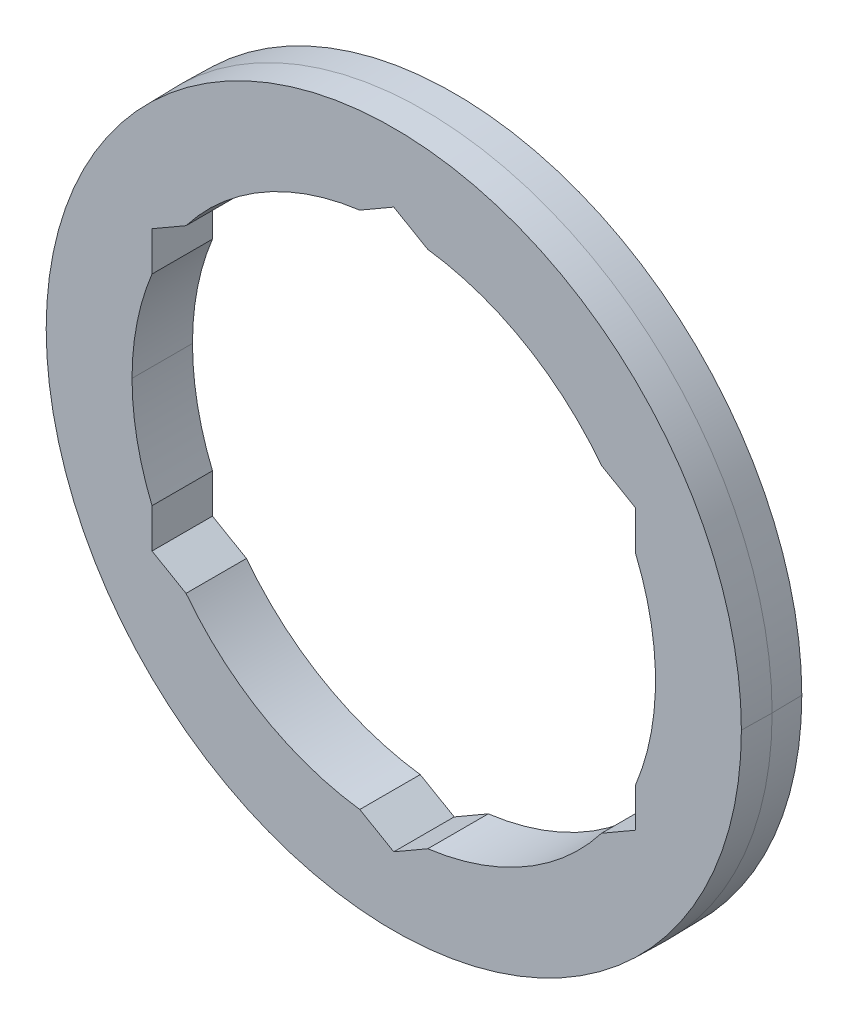
ISO-10303-21;
HEADER;
FILE_DESCRIPTION(('STEP AP214'),'2;1');
FILE_NAME('part.step','',(''),(''),'','','');
FILE_SCHEMA(('AUTOMOTIVE_DESIGN { 1 0 10303 214 1 1 1 1 }'));
ENDSEC;
DATA;
#1=APPLICATION_CONTEXT('core data for automotive mechanical design processes');
#2=APPLICATION_PROTOCOL_DEFINITION('international standard','automotive_design',2000,#1);
#3=PRODUCT_CONTEXT('',#1,'mechanical');
#4=PRODUCT('Part','Part','',(#3));
#5=PRODUCT_RELATED_PRODUCT_CATEGORY('part','',(#4));
#6=PRODUCT_DEFINITION_FORMATION('','',#4);
#7=PRODUCT_DEFINITION_CONTEXT('part definition',#1,'design');
#8=PRODUCT_DEFINITION('design','',#6,#7);
#9=PRODUCT_DEFINITION_SHAPE('','',#8);
#10=(LENGTH_UNIT() NAMED_UNIT(*) SI_UNIT(.MILLI.,.METRE.));
#11=(NAMED_UNIT(*) PLANE_ANGLE_UNIT() SI_UNIT($,.RADIAN.));
#12=(NAMED_UNIT(*) SI_UNIT($,.STERADIAN.) SOLID_ANGLE_UNIT());
#13=UNCERTAINTY_MEASURE_WITH_UNIT(LENGTH_MEASURE(1.E-05),#10,'distance_accuracy_value','');
#14=(GEOMETRIC_REPRESENTATION_CONTEXT(3) GLOBAL_UNCERTAINTY_ASSIGNED_CONTEXT((#13)) GLOBAL_UNIT_ASSIGNED_CONTEXT((#10,
#11,#12)) REPRESENTATION_CONTEXT('',''));
#15=CARTESIAN_POINT('',(0.,0.,0.));
#16=DIRECTION('',(0.,0.,1.));
#17=DIRECTION('',(1.,0.,0.));
#18=AXIS2_PLACEMENT_3D('',#15,#16,#17);
#19=CARTESIAN_POINT('',(0.,0.,-0.79375));
#20=DIRECTION('',(0.,0.,1.));
#21=DIRECTION('',(1.,0.,0.));
#22=AXIS2_PLACEMENT_3D('',#19,#20,#21);
#23=PLANE('',#22);
#24=CARTESIAN_POINT('',(0.,0.,-0.79375));
#25=DIRECTION('',(0.,0.,1.));
#26=DIRECTION('',(1.,0.,0.));
#27=AXIS2_PLACEMENT_3D('',#24,#25,#26);
#28=CIRCLE('',#27,6.874999966);
#29=CARTESIAN_POINT('',(5.45696042896782,4.18177084608655,-0.79375));
#30=VERTEX_POINT('',#29);
#31=CARTESIAN_POINT('',(0.89303957103219,6.81675178197583,-0.79375));
#32=VERTEX_POINT('',#31);
#33=EDGE_CURVE('E363',#30,#32,#28,.T.);
#34=ORIENTED_EDGE('',*,*,#33,.T.);
#35=DIRECTION('',(-0.866025403784439,0.5,0.));
#36=VECTOR('',#35,1.);
#37=CARTESIAN_POINT('',(3.175,5.49926131403119,-0.79375));
#38=LINE('',#37,#36);
#39=CARTESIAN_POINT('',(0.,7.33234841870825,-0.79375));
#40=VERTEX_POINT('',#39);
#41=EDGE_CURVE('E259',#32,#40,#38,.T.);
#42=ORIENTED_EDGE('',*,*,#41,.T.);
#43=DIRECTION('',(-0.866025403784439,-0.5,0.));
#44=VECTOR('',#43,1.);
#45=CARTESIAN_POINT('',(-3.175,5.49926131403119,-0.79375));
#46=LINE('',#45,#44);
#47=CARTESIAN_POINT('',(-0.893039571032188,6.81675178197583,-0.79375));
#48=VERTEX_POINT('',#47);
#49=EDGE_CURVE('E250',#40,#48,#46,.T.);
#50=ORIENTED_EDGE('',*,*,#49,.T.);
#51=CARTESIAN_POINT('',(0.,0.,-0.79375));
#52=DIRECTION('',(0.,0.,1.));
#53=DIRECTION('',(1.,0.,0.));
#54=AXIS2_PLACEMENT_3D('',#51,#52,#53);
#55=CIRCLE('',#54,6.874999966);
#56=CARTESIAN_POINT('',(-5.45696042896781,4.18177084608655,-0.79375));
#57=VERTEX_POINT('',#56);
#58=EDGE_CURVE('E219',#48,#57,#55,.T.);
#59=ORIENTED_EDGE('',*,*,#58,.T.);
#60=DIRECTION('',(-0.866025403784439,-0.5,0.));
#61=VECTOR('',#60,1.);
#62=CARTESIAN_POINT('',(-3.175,5.49926131403119,-0.79375));
#63=LINE('',#62,#61);
#64=CARTESIAN_POINT('',(-6.35,3.66617420935413,-0.79375));
#65=VERTEX_POINT('',#64);
#66=EDGE_CURVE('E243',#57,#65,#63,.T.);
#67=ORIENTED_EDGE('',*,*,#66,.T.);
#68=DIRECTION('',(0.,-1.,0.));
#69=VECTOR('',#68,1.);
#70=CARTESIAN_POINT('',(-6.35,0.,-0.79375));
#71=LINE('',#70,#69);
#72=CARTESIAN_POINT('',(-6.35,2.63498093588929,-0.79375));
#73=VERTEX_POINT('',#72);
#74=EDGE_CURVE('E278',#65,#73,#71,.T.);
#75=ORIENTED_EDGE('',*,*,#74,.T.);
#76=CARTESIAN_POINT('',(0.,0.,-0.79375));
#77=DIRECTION('',(0.,0.,1.));
#78=DIRECTION('',(1.,0.,0.));
#79=AXIS2_PLACEMENT_3D('',#76,#77,#78);
#80=CIRCLE('',#79,6.874999966);
#81=CARTESIAN_POINT('',(-6.874999966,0.,-0.79375));
#82=VERTEX_POINT('',#81);
#83=EDGE_CURVE('E396',#73,#82,#80,.T.);
#84=ORIENTED_EDGE('',*,*,#83,.T.);
#85=CARTESIAN_POINT('',(0.,0.,-0.79375));
#86=DIRECTION('',(0.,0.,1.));
#87=DIRECTION('',(1.,0.,0.));
#88=AXIS2_PLACEMENT_3D('',#85,#86,#87);
#89=CIRCLE('',#88,6.874999966);
#90=CARTESIAN_POINT('',(-6.35,-2.63498093588929,-0.79375));
#91=VERTEX_POINT('',#90);
#92=EDGE_CURVE('E282',#82,#91,#89,.T.);
#93=ORIENTED_EDGE('',*,*,#92,.T.);
#94=DIRECTION('',(0.,-1.,0.));
#95=VECTOR('',#94,1.);
#96=CARTESIAN_POINT('',(-6.35,0.,-0.79375));
#97=LINE('',#96,#95);
#98=CARTESIAN_POINT('',(-6.35,-3.66617420935412,-0.79375));
#99=VERTEX_POINT('',#98);
#100=EDGE_CURVE('E217',#91,#99,#97,.T.);
#101=ORIENTED_EDGE('',*,*,#100,.T.);
#102=DIRECTION('',(0.866025403784439,-0.5,0.));
#103=VECTOR('',#102,1.);
#104=CARTESIAN_POINT('',(-3.175,-5.49926131403119,-0.79375));
#105=LINE('',#104,#103);
#106=CARTESIAN_POINT('',(-5.45696042896782,-4.18177084608655,-0.79375));
#107=VERTEX_POINT('',#106);
#108=EDGE_CURVE('E336',#99,#107,#105,.T.);
#109=ORIENTED_EDGE('',*,*,#108,.T.);
#110=CARTESIAN_POINT('',(0.,0.,-0.79375));
#111=DIRECTION('',(0.,0.,1.));
#112=DIRECTION('',(1.,0.,0.));
#113=AXIS2_PLACEMENT_3D('',#110,#111,#112);
#114=CIRCLE('',#113,6.874999966);
#115=CARTESIAN_POINT('',(-0.893039571032186,-6.81675178197583,-0.79375));
#116=VERTEX_POINT('',#115);
#117=EDGE_CURVE('E328',#107,#116,#114,.T.);
#118=ORIENTED_EDGE('',*,*,#117,.T.);
#119=DIRECTION('',(0.866025403784439,-0.5,0.));
#120=VECTOR('',#119,1.);
#121=CARTESIAN_POINT('',(-3.175,-5.49926131403119,-0.79375));
#122=LINE('',#121,#120);
#123=CARTESIAN_POINT('',(0.,-7.33234841870825,-0.79375));
#124=VERTEX_POINT('',#123);
#125=EDGE_CURVE('E291',#116,#124,#122,.T.);
#126=ORIENTED_EDGE('',*,*,#125,.T.);
#127=DIRECTION('',(0.866025403784439,0.5,0.));
#128=VECTOR('',#127,1.);
#129=CARTESIAN_POINT('',(3.175,-5.49926131403119,-0.79375));
#130=LINE('',#129,#128);
#131=CARTESIAN_POINT('',(0.893039571032181,-6.81675178197583,-0.79375));
#132=VERTEX_POINT('',#131);
#133=EDGE_CURVE('E238',#124,#132,#130,.T.);
#134=ORIENTED_EDGE('',*,*,#133,.T.);
#135=CARTESIAN_POINT('',(0.,0.,-0.79375));
#136=DIRECTION('',(0.,0.,1.));
#137=DIRECTION('',(1.,0.,0.));
#138=AXIS2_PLACEMENT_3D('',#135,#136,#137);
#139=CIRCLE('',#138,6.874999966);
#140=CARTESIAN_POINT('',(5.45696042896782,-4.18177084608655,-0.79375));
#141=VERTEX_POINT('',#140);
#142=EDGE_CURVE('E228',#132,#141,#139,.T.);
#143=ORIENTED_EDGE('',*,*,#142,.T.);
#144=DIRECTION('',(0.866025403784439,0.5,0.));
#145=VECTOR('',#144,1.);
#146=CARTESIAN_POINT('',(3.175,-5.49926131403119,-0.79375));
#147=LINE('',#146,#145);
#148=CARTESIAN_POINT('',(6.35,-3.66617420935412,-0.79375));
#149=VERTEX_POINT('',#148);
#150=EDGE_CURVE('E182',#141,#149,#147,.T.);
#151=ORIENTED_EDGE('',*,*,#150,.T.);
#152=DIRECTION('',(0.,1.,0.));
#153=VECTOR('',#152,1.);
#154=CARTESIAN_POINT('',(6.35,0.,-0.79375));
#155=LINE('',#154,#153);
#156=CARTESIAN_POINT('',(6.35,-2.6349809358893,-0.79375));
#157=VERTEX_POINT('',#156);
#158=EDGE_CURVE('E174',#149,#157,#155,.T.);
#159=ORIENTED_EDGE('',*,*,#158,.T.);
#160=CARTESIAN_POINT('',(0.,0.,-0.79375));
#161=DIRECTION('',(0.,0.,1.));
#162=DIRECTION('',(1.,0.,0.));
#163=AXIS2_PLACEMENT_3D('',#160,#161,#162);
#164=CIRCLE('',#163,6.874999966);
#165=CARTESIAN_POINT('',(6.35,2.6349809358893,-0.79375));
#166=VERTEX_POINT('',#165);
#167=EDGE_CURVE('E179',#157,#166,#164,.T.);
#168=ORIENTED_EDGE('',*,*,#167,.T.);
#169=DIRECTION('',(0.,1.,0.));
#170=VECTOR('',#169,1.);
#171=CARTESIAN_POINT('',(6.35,0.,-0.79375));
#172=LINE('',#171,#170);
#173=CARTESIAN_POINT('',(6.35,3.66617420935413,-0.79375));
#174=VERTEX_POINT('',#173);
#175=EDGE_CURVE('E300',#166,#174,#172,.T.);
#176=ORIENTED_EDGE('',*,*,#175,.T.);
#177=DIRECTION('',(-0.866025403784439,0.5,0.));
#178=VECTOR('',#177,1.);
#179=CARTESIAN_POINT('',(3.175,5.49926131403119,-0.79375));
#180=LINE('',#179,#178);
#181=EDGE_CURVE('E315',#174,#30,#180,.T.);
#182=ORIENTED_EDGE('',*,*,#181,.T.);
#183=EDGE_LOOP('',(#34,#42,#50,#59,#67,#75,#84,#93,#101,#109,#118,#126,#134,#143,#151,#159,#168,
#176,#182));
#184=FACE_BOUND('',#183,.T.);
#185=CARTESIAN_POINT('',(0.,0.,-0.79375));
#186=DIRECTION('',(0.,0.,1.));
#187=DIRECTION('',(1.,0.,0.));
#188=AXIS2_PLACEMENT_3D('',#185,#186,#187);
#189=CIRCLE('',#188,9.13014504221323);
#190=CARTESIAN_POINT('',(-9.13014504221323,0.,-0.79375));
#191=VERTEX_POINT('',#190);
#192=CARTESIAN_POINT('',(9.13014504221323,0.,-0.79375));
#193=VERTEX_POINT('',#192);
#194=EDGE_CURVE('E354',#191,#193,#189,.T.);
#195=ORIENTED_EDGE('',*,*,#194,.F.);
#196=CARTESIAN_POINT('',(0.,0.,-0.79375));
#197=DIRECTION('',(0.,0.,1.));
#198=DIRECTION('',(1.,0.,0.));
#199=AXIS2_PLACEMENT_3D('',#196,#197,#198);
#200=CIRCLE('',#199,9.13014504221323);
#201=EDGE_CURVE('E11',#193,#191,#200,.T.);
#202=ORIENTED_EDGE('',*,*,#201,.F.);
#203=EDGE_LOOP('',(#195,#202));
#204=FACE_BOUND('',#203,.T.);
#205=ADVANCED_FACE('F16',(#184,#204),#23,.F.);
#206=CARTESIAN_POINT('',(0.,0.,0.79375));
#207=DIRECTION('',(0.,0.,1.));
#208=DIRECTION('',(1.,0.,0.));
#209=AXIS2_PLACEMENT_3D('',#206,#207,#208);
#210=PLANE('',#209);
#211=CARTESIAN_POINT('',(0.,0.,0.79375));
#212=DIRECTION('',(0.,0.,1.));
#213=DIRECTION('',(1.,0.,0.));
#214=AXIS2_PLACEMENT_3D('',#211,#212,#213);
#215=CIRCLE('',#214,6.874999966);
#216=CARTESIAN_POINT('',(5.45696042896782,4.18177084608655,0.79375));
#217=VERTEX_POINT('',#216);
#218=CARTESIAN_POINT('',(0.89303957103219,6.81675178197583,0.79375));
#219=VERTEX_POINT('',#218);
#220=EDGE_CURVE('E244',#217,#219,#215,.T.);
#221=ORIENTED_EDGE('',*,*,#220,.F.);
#222=DIRECTION('',(-0.866025403784439,0.5,0.));
#223=VECTOR('',#222,1.);
#224=CARTESIAN_POINT('',(3.175,5.49926131403119,0.79375));
#225=LINE('',#224,#223);
#226=CARTESIAN_POINT('',(6.35,3.66617420935413,0.79375));
#227=VERTEX_POINT('',#226);
#228=EDGE_CURVE('E297',#227,#217,#225,.T.);
#229=ORIENTED_EDGE('',*,*,#228,.F.);
#230=DIRECTION('',(0.,1.,0.));
#231=VECTOR('',#230,1.);
#232=CARTESIAN_POINT('',(6.35,0.,0.79375));
#233=LINE('',#232,#231);
#234=CARTESIAN_POINT('',(6.35,2.6349809358893,0.79375));
#235=VERTEX_POINT('',#234);
#236=EDGE_CURVE('E203',#235,#227,#233,.T.);
#237=ORIENTED_EDGE('',*,*,#236,.F.);
#238=CARTESIAN_POINT('',(0.,0.,0.79375));
#239=DIRECTION('',(0.,0.,1.));
#240=DIRECTION('',(1.,0.,0.));
#241=AXIS2_PLACEMENT_3D('',#238,#239,#240);
#242=CIRCLE('',#241,6.874999966);
#243=CARTESIAN_POINT('',(6.35,-2.6349809358893,0.79375));
#244=VERTEX_POINT('',#243);
#245=EDGE_CURVE('E187',#244,#235,#242,.T.);
#246=ORIENTED_EDGE('',*,*,#245,.F.);
#247=DIRECTION('',(0.,1.,0.));
#248=VECTOR('',#247,1.);
#249=CARTESIAN_POINT('',(6.35,0.,0.79375));
#250=LINE('',#249,#248);
#251=CARTESIAN_POINT('',(6.35,-3.66617420935412,0.79375));
#252=VERTEX_POINT('',#251);
#253=EDGE_CURVE('E193',#252,#244,#250,.T.);
#254=ORIENTED_EDGE('',*,*,#253,.F.);
#255=DIRECTION('',(0.866025403784439,0.5,0.));
#256=VECTOR('',#255,1.);
#257=CARTESIAN_POINT('',(3.175,-5.49926131403119,0.79375));
#258=LINE('',#257,#256);
#259=CARTESIAN_POINT('',(5.45696042896782,-4.18177084608655,0.79375));
#260=VERTEX_POINT('',#259);
#261=EDGE_CURVE('E231',#260,#252,#258,.T.);
#262=ORIENTED_EDGE('',*,*,#261,.F.);
#263=CARTESIAN_POINT('',(0.,0.,0.79375));
#264=DIRECTION('',(0.,0.,1.));
#265=DIRECTION('',(1.,0.,0.));
#266=AXIS2_PLACEMENT_3D('',#263,#264,#265);
#267=CIRCLE('',#266,6.874999966);
#268=CARTESIAN_POINT('',(0.893039571032181,-6.81675178197583,0.79375));
#269=VERTEX_POINT('',#268);
#270=EDGE_CURVE('E271',#269,#260,#267,.T.);
#271=ORIENTED_EDGE('',*,*,#270,.F.);
#272=DIRECTION('',(0.866025403784439,0.5,0.));
#273=VECTOR('',#272,1.);
#274=CARTESIAN_POINT('',(3.175,-5.49926131403119,0.79375));
#275=LINE('',#274,#273);
#276=CARTESIAN_POINT('',(0.,-7.33234841870825,0.79375));
#277=VERTEX_POINT('',#276);
#278=EDGE_CURVE('E237',#277,#269,#275,.T.);
#279=ORIENTED_EDGE('',*,*,#278,.F.);
#280=DIRECTION('',(0.866025403784439,-0.5,0.));
#281=VECTOR('',#280,1.);
#282=CARTESIAN_POINT('',(-3.175,-5.49926131403119,0.79375));
#283=LINE('',#282,#281);
#284=CARTESIAN_POINT('',(-0.893039571032186,-6.81675178197583,0.79375));
#285=VERTEX_POINT('',#284);
#286=EDGE_CURVE('E290',#285,#277,#283,.T.);
#287=ORIENTED_EDGE('',*,*,#286,.F.);
#288=CARTESIAN_POINT('',(0.,0.,0.79375));
#289=DIRECTION('',(0.,0.,1.));
#290=DIRECTION('',(1.,0.,0.));
#291=AXIS2_PLACEMENT_3D('',#288,#289,#290);
#292=CIRCLE('',#291,6.874999966);
#293=CARTESIAN_POINT('',(-5.45696042896782,-4.18177084608655,0.79375));
#294=VERTEX_POINT('',#293);
#295=EDGE_CURVE('E386',#294,#285,#292,.T.);
#296=ORIENTED_EDGE('',*,*,#295,.F.);
#297=DIRECTION('',(0.866025403784439,-0.5,0.));
#298=VECTOR('',#297,1.);
#299=CARTESIAN_POINT('',(-3.175,-5.49926131403119,0.79375));
#300=LINE('',#299,#298);
#301=CARTESIAN_POINT('',(-6.35,-3.66617420935412,0.79375));
#302=VERTEX_POINT('',#301);
#303=EDGE_CURVE('E215',#302,#294,#300,.T.);
#304=ORIENTED_EDGE('',*,*,#303,.F.);
#305=DIRECTION('',(0.,-1.,0.));
#306=VECTOR('',#305,1.);
#307=CARTESIAN_POINT('',(-6.35,0.,0.79375));
#308=LINE('',#307,#306);
#309=CARTESIAN_POINT('',(-6.35,-2.63498093588929,0.79375));
#310=VERTEX_POINT('',#309);
#311=EDGE_CURVE('E340',#310,#302,#308,.T.);
#312=ORIENTED_EDGE('',*,*,#311,.F.);
#313=CARTESIAN_POINT('',(0.,0.,0.79375));
#314=DIRECTION('',(0.,0.,1.));
#315=DIRECTION('',(1.,0.,0.));
#316=AXIS2_PLACEMENT_3D('',#313,#314,#315);
#317=CIRCLE('',#316,6.874999966);
#318=CARTESIAN_POINT('',(-6.874999966,0.,0.79375));
#319=VERTEX_POINT('',#318);
#320=EDGE_CURVE('E285',#319,#310,#317,.T.);
#321=ORIENTED_EDGE('',*,*,#320,.F.);
#322=CARTESIAN_POINT('',(0.,0.,0.79375));
#323=DIRECTION('',(0.,0.,1.));
#324=DIRECTION('',(1.,0.,0.));
#325=AXIS2_PLACEMENT_3D('',#322,#323,#324);
#326=CIRCLE('',#325,6.874999966);
#327=CARTESIAN_POINT('',(-6.35,2.63498093588929,0.79375));
#328=VERTEX_POINT('',#327);
#329=EDGE_CURVE('E276',#328,#319,#326,.T.);
#330=ORIENTED_EDGE('',*,*,#329,.F.);
#331=DIRECTION('',(0.,-1.,0.));
#332=VECTOR('',#331,1.);
#333=CARTESIAN_POINT('',(-6.35,0.,0.79375));
#334=LINE('',#333,#332);
#335=CARTESIAN_POINT('',(-6.35,3.66617420935413,0.79375));
#336=VERTEX_POINT('',#335);
#337=EDGE_CURVE('E263',#336,#328,#334,.T.);
#338=ORIENTED_EDGE('',*,*,#337,.F.);
#339=DIRECTION('',(-0.866025403784439,-0.5,0.));
#340=VECTOR('',#339,1.);
#341=CARTESIAN_POINT('',(-3.175,5.49926131403119,0.79375));
#342=LINE('',#341,#340);
#343=CARTESIAN_POINT('',(-5.45696042896781,4.18177084608655,0.79375));
#344=VERTEX_POINT('',#343);
#345=EDGE_CURVE('E223',#344,#336,#342,.T.);
#346=ORIENTED_EDGE('',*,*,#345,.F.);
#347=CARTESIAN_POINT('',(0.,0.,0.79375));
#348=DIRECTION('',(0.,0.,1.));
#349=DIRECTION('',(1.,0.,0.));
#350=AXIS2_PLACEMENT_3D('',#347,#348,#349);
#351=CIRCLE('',#350,6.874999966);
#352=CARTESIAN_POINT('',(-0.893039571032188,6.81675178197583,0.79375));
#353=VERTEX_POINT('',#352);
#354=EDGE_CURVE('E254',#353,#344,#351,.T.);
#355=ORIENTED_EDGE('',*,*,#354,.F.);
#356=DIRECTION('',(-0.866025403784439,-0.5,0.));
#357=VECTOR('',#356,1.);
#358=CARTESIAN_POINT('',(-3.175,5.49926131403119,0.79375));
#359=LINE('',#358,#357);
#360=CARTESIAN_POINT('',(0.,7.33234841870825,0.79375));
#361=VERTEX_POINT('',#360);
#362=EDGE_CURVE('E255',#361,#353,#359,.T.);
#363=ORIENTED_EDGE('',*,*,#362,.F.);
#364=DIRECTION('',(-0.866025403784439,0.5,0.));
#365=VECTOR('',#364,1.);
#366=CARTESIAN_POINT('',(3.175,5.49926131403119,0.79375));
#367=LINE('',#366,#365);
#368=EDGE_CURVE('E27',#219,#361,#367,.T.);
#369=ORIENTED_EDGE('',*,*,#368,.F.);
#370=EDGE_LOOP('',(#221,#229,#237,#246,#254,#262,#271,#279,#287,#296,#304,#312,#321,#330,#338,
#346,#355,#363,#369));
#371=FACE_BOUND('',#370,.T.);
#372=CARTESIAN_POINT('',(0.,0.,0.79375));
#373=DIRECTION('',(0.,0.,1.));
#374=DIRECTION('',(1.,0.,0.));
#375=AXIS2_PLACEMENT_3D('',#372,#373,#374);
#376=CIRCLE('',#375,9.13014504221323);
#377=CARTESIAN_POINT('',(9.13014504221323,0.,0.79375));
#378=VERTEX_POINT('',#377);
#379=CARTESIAN_POINT('',(-9.13014504221323,0.,0.79375));
#380=VERTEX_POINT('',#379);
#381=EDGE_CURVE('E360',#378,#380,#376,.T.);
#382=ORIENTED_EDGE('',*,*,#381,.T.);
#383=CARTESIAN_POINT('',(0.,0.,0.79375));
#384=DIRECTION('',(0.,0.,1.));
#385=DIRECTION('',(1.,0.,0.));
#386=AXIS2_PLACEMENT_3D('',#383,#384,#385);
#387=CIRCLE('',#386,9.13014504221323);
#388=EDGE_CURVE('E296',#380,#378,#387,.T.);
#389=ORIENTED_EDGE('',*,*,#388,.T.);
#390=EDGE_LOOP('',(#382,#389));
#391=FACE_BOUND('',#390,.T.);
#392=ADVANCED_FACE('F462',(#371,#391),#210,.T.);
#393=CARTESIAN_POINT('',(0.,0.,0.));
#394=DIRECTION('',(0.,0.,1.));
#395=DIRECTION('',(-1.,0.,0.));
#396=AXIS2_PLACEMENT_3D('',#393,#394,#395);
#397=CONICAL_SURFACE('',#396,9.144,0.0174532925199415);
#398=DIRECTION('',(0.0174524064372835,0.,0.999847695156391));
#399=VECTOR('',#398,1.);
#400=CARTESIAN_POINT('',(9.144,0.,0.));
#401=LINE('',#400,#399);
#402=CARTESIAN_POINT('',(9.144,0.,0.));
#403=VERTEX_POINT('',#402);
#404=EDGE_CURVE('E350',#193,#403,#401,.T.);
#405=ORIENTED_EDGE('',*,*,#404,.F.);
#406=ORIENTED_EDGE('',*,*,#201,.T.);
#407=DIRECTION('',(-0.0174524064372835,0.,0.999847695156391));
#408=VECTOR('',#407,1.);
#409=CARTESIAN_POINT('',(-9.144,0.,0.));
#410=LINE('',#409,#408);
#411=CARTESIAN_POINT('',(-9.144,0.,0.));
#412=VERTEX_POINT('',#411);
#413=EDGE_CURVE('E272',#191,#412,#410,.T.);
#414=ORIENTED_EDGE('',*,*,#413,.T.);
#415=CARTESIAN_POINT('',(0.,0.,0.));
#416=DIRECTION('',(0.,0.,1.));
#417=DIRECTION('',(1.,0.,0.));
#418=AXIS2_PLACEMENT_3D('',#415,#416,#417);
#419=CIRCLE('',#418,9.144);
#420=EDGE_CURVE('E213',#403,#412,#419,.T.);
#421=ORIENTED_EDGE('',*,*,#420,.F.);
#422=EDGE_LOOP('',(#405,#406,#414,#421));
#423=FACE_BOUND('',#422,.T.);
#424=ADVANCED_FACE('F512',(#423),#397,.T.);
#425=CARTESIAN_POINT('',(3.175,5.49926131403119,0.79375));
#426=DIRECTION('',(-0.5,-0.866025403784439,0.));
#427=DIRECTION('',(-0.866025403784439,0.5,0.));
#428=AXIS2_PLACEMENT_3D('',#425,#426,#427);
#429=PLANE('',#428);
#430=ORIENTED_EDGE('',*,*,#41,.F.);
#431=DIRECTION('',(0.,0.,-1.));
#432=VECTOR('',#431,1.);
#433=CARTESIAN_POINT('',(0.89303957103219,6.81675178197583,0.79375));
#434=LINE('',#433,#432);
#435=EDGE_CURVE('E248',#219,#32,#434,.T.);
#436=ORIENTED_EDGE('',*,*,#435,.F.);
#437=ORIENTED_EDGE('',*,*,#368,.T.);
#438=DIRECTION('',(0.,0.,-1.));
#439=VECTOR('',#438,1.);
#440=CARTESIAN_POINT('',(0.,7.33234841870825,0.79375));
#441=LINE('',#440,#439);
#442=EDGE_CURVE('E253',#361,#40,#441,.T.);
#443=ORIENTED_EDGE('',*,*,#442,.T.);
#444=EDGE_LOOP('',(#430,#436,#437,#443));
#445=FACE_BOUND('',#444,.T.);
#446=ADVANCED_FACE('F486',(#445),#429,.T.);
#447=CARTESIAN_POINT('',(-3.175,5.49926131403119,0.79375));
#448=DIRECTION('',(0.5,-0.866025403784439,0.));
#449=DIRECTION('',(0.,0.,-1.));
#450=AXIS2_PLACEMENT_3D('',#447,#448,#449);
#451=PLANE('',#450);
#452=ORIENTED_EDGE('',*,*,#49,.F.);
#453=ORIENTED_EDGE('',*,*,#442,.F.);
#454=ORIENTED_EDGE('',*,*,#362,.T.);
#455=DIRECTION('',(0.,0.,-1.));
#456=VECTOR('',#455,1.);
#457=CARTESIAN_POINT('',(-0.893039571032188,6.81675178197583,0.79375));
#458=LINE('',#457,#456);
#459=EDGE_CURVE('E222',#353,#48,#458,.T.);
#460=ORIENTED_EDGE('',*,*,#459,.T.);
#461=EDGE_LOOP('',(#452,#453,#454,#460));
#462=FACE_BOUND('',#461,.T.);
#463=ADVANCED_FACE('F530',(#462),#451,.T.);
#464=CARTESIAN_POINT('',(0.,0.,0.79375));
#465=DIRECTION('',(0.,0.,-1.));
#466=DIRECTION('',(-1.,0.,0.));
#467=AXIS2_PLACEMENT_3D('',#464,#465,#466);
#468=CYLINDRICAL_SURFACE('',#467,6.874999966);
#469=ORIENTED_EDGE('',*,*,#58,.F.);
#470=ORIENTED_EDGE('',*,*,#459,.F.);
#471=ORIENTED_EDGE('',*,*,#354,.T.);
#472=DIRECTION('',(0.,0.,-1.));
#473=VECTOR('',#472,1.);
#474=CARTESIAN_POINT('',(-5.45696042896781,4.18177084608655,0.79375));
#475=LINE('',#474,#473);
#476=EDGE_CURVE('E239',#344,#57,#475,.T.);
#477=ORIENTED_EDGE('',*,*,#476,.T.);
#478=EDGE_LOOP('',(#469,#470,#471,#477));
#479=FACE_BOUND('',#478,.T.);
#480=ADVANCED_FACE('F528',(#479),#468,.F.);
#481=CARTESIAN_POINT('',(-3.175,5.49926131403119,0.79375));
#482=DIRECTION('',(0.5,-0.866025403784439,0.));
#483=DIRECTION('',(0.,0.,-1.));
#484=AXIS2_PLACEMENT_3D('',#481,#482,#483);
#485=PLANE('',#484);
#486=ORIENTED_EDGE('',*,*,#66,.F.);
#487=ORIENTED_EDGE('',*,*,#476,.F.);
#488=ORIENTED_EDGE('',*,*,#345,.T.);
#489=DIRECTION('',(0.,0.,-1.));
#490=VECTOR('',#489,1.);
#491=CARTESIAN_POINT('',(-6.35,3.66617420935413,0.79375));
#492=LINE('',#491,#490);
#493=EDGE_CURVE('E281',#336,#65,#492,.T.);
#494=ORIENTED_EDGE('',*,*,#493,.T.);
#495=EDGE_LOOP('',(#486,#487,#488,#494));
#496=FACE_BOUND('',#495,.T.);
#497=ADVANCED_FACE('F458',(#496),#485,.T.);
#498=CARTESIAN_POINT('',(-6.35,0.,0.79375));
#499=DIRECTION('',(1.,0.,0.));
#500=DIRECTION('',(0.,-1.,0.));
#501=AXIS2_PLACEMENT_3D('',#498,#499,#500);
#502=PLANE('',#501);
#503=ORIENTED_EDGE('',*,*,#74,.F.);
#504=ORIENTED_EDGE('',*,*,#493,.F.);
#505=ORIENTED_EDGE('',*,*,#337,.T.);
#506=DIRECTION('',(0.,0.,-1.));
#507=VECTOR('',#506,1.);
#508=CARTESIAN_POINT('',(-6.35,2.63498093588929,0.79375));
#509=LINE('',#508,#507);
#510=EDGE_CURVE('E349',#328,#73,#509,.T.);
#511=ORIENTED_EDGE('',*,*,#510,.T.);
#512=EDGE_LOOP('',(#503,#504,#505,#511));
#513=FACE_BOUND('',#512,.T.);
#514=ADVANCED_FACE('F446',(#513),#502,.T.);
#515=CARTESIAN_POINT('',(0.,0.,0.79375));
#516=DIRECTION('',(0.,0.,-1.));
#517=DIRECTION('',(-1.,0.,0.));
#518=AXIS2_PLACEMENT_3D('',#515,#516,#517);
#519=CYLINDRICAL_SURFACE('',#518,6.874999966);
#520=DIRECTION('',(0.,0.,-1.));
#521=VECTOR('',#520,1.);
#522=CARTESIAN_POINT('',(-6.874999966,0.,0.79375));
#523=LINE('',#522,#521);
#524=EDGE_CURVE('E395',#319,#82,#523,.T.);
#525=ORIENTED_EDGE('',*,*,#524,.F.);
#526=ORIENTED_EDGE('',*,*,#320,.T.);
#527=DIRECTION('',(0.,0.,-1.));
#528=VECTOR('',#527,1.);
#529=CARTESIAN_POINT('',(-6.35,-2.63498093588929,0.79375));
#530=LINE('',#529,#528);
#531=EDGE_CURVE('E227',#310,#91,#530,.T.);
#532=ORIENTED_EDGE('',*,*,#531,.T.);
#533=ORIENTED_EDGE('',*,*,#92,.F.);
#534=EDGE_LOOP('',(#525,#526,#532,#533));
#535=FACE_BOUND('',#534,.T.);
#536=ADVANCED_FACE('F515',(#535),#519,.F.);
#537=CARTESIAN_POINT('',(-6.35,0.,0.79375));
#538=DIRECTION('',(1.,0.,0.));
#539=DIRECTION('',(0.,-1.,0.));
#540=AXIS2_PLACEMENT_3D('',#537,#538,#539);
#541=PLANE('',#540);
#542=ORIENTED_EDGE('',*,*,#100,.F.);
#543=ORIENTED_EDGE('',*,*,#531,.F.);
#544=ORIENTED_EDGE('',*,*,#311,.T.);
#545=DIRECTION('',(0.,0.,-1.));
#546=VECTOR('',#545,1.);
#547=CARTESIAN_POINT('',(-6.35,-3.66617420935412,0.79375));
#548=LINE('',#547,#546);
#549=EDGE_CURVE('E218',#302,#99,#548,.T.);
#550=ORIENTED_EDGE('',*,*,#549,.T.);
#551=EDGE_LOOP('',(#542,#543,#544,#550));
#552=FACE_BOUND('',#551,.T.);
#553=ADVANCED_FACE('F521',(#552),#541,.T.);
#554=CARTESIAN_POINT('',(-3.175,-5.49926131403119,0.79375));
#555=DIRECTION('',(0.5,0.866025403784439,0.));
#556=DIRECTION('',(0.,0.,-1.));
#557=AXIS2_PLACEMENT_3D('',#554,#555,#556);
#558=PLANE('',#557);
#559=ORIENTED_EDGE('',*,*,#108,.F.);
#560=ORIENTED_EDGE('',*,*,#549,.F.);
#561=ORIENTED_EDGE('',*,*,#303,.T.);
#562=DIRECTION('',(0.,0.,-1.));
#563=VECTOR('',#562,1.);
#564=CARTESIAN_POINT('',(-5.45696042896782,-4.18177084608655,0.79375));
#565=LINE('',#564,#563);
#566=EDGE_CURVE('E331',#294,#107,#565,.T.);
#567=ORIENTED_EDGE('',*,*,#566,.T.);
#568=EDGE_LOOP('',(#559,#560,#561,#567));
#569=FACE_BOUND('',#568,.T.);
#570=ADVANCED_FACE('F523',(#569),#558,.T.);
#571=CARTESIAN_POINT('',(0.,0.,0.79375));
#572=DIRECTION('',(0.,0.,-1.));
#573=DIRECTION('',(-1.,0.,0.));
#574=AXIS2_PLACEMENT_3D('',#571,#572,#573);
#575=CYLINDRICAL_SURFACE('',#574,6.874999966);
#576=ORIENTED_EDGE('',*,*,#117,.F.);
#577=ORIENTED_EDGE('',*,*,#566,.F.);
#578=ORIENTED_EDGE('',*,*,#295,.T.);
#579=DIRECTION('',(0.,0.,-1.));
#580=VECTOR('',#579,1.);
#581=CARTESIAN_POINT('',(-0.893039571032186,-6.81675178197583,0.79375));
#582=LINE('',#581,#580);
#583=EDGE_CURVE('E286',#285,#116,#582,.T.);
#584=ORIENTED_EDGE('',*,*,#583,.T.);
#585=EDGE_LOOP('',(#576,#577,#578,#584));
#586=FACE_BOUND('',#585,.T.);
#587=ADVANCED_FACE('F18',(#586),#575,.F.);
#588=CARTESIAN_POINT('',(-3.175,-5.49926131403119,0.79375));
#589=DIRECTION('',(0.5,0.866025403784439,0.));
#590=DIRECTION('',(0.,0.,-1.));
#591=AXIS2_PLACEMENT_3D('',#588,#589,#590);
#592=PLANE('',#591);
#593=ORIENTED_EDGE('',*,*,#125,.F.);
#594=ORIENTED_EDGE('',*,*,#583,.F.);
#595=ORIENTED_EDGE('',*,*,#286,.T.);
#596=DIRECTION('',(0.,0.,-1.));
#597=VECTOR('',#596,1.);
#598=CARTESIAN_POINT('',(0.,-7.33234841870825,0.79375));
#599=LINE('',#598,#597);
#600=EDGE_CURVE('E233',#277,#124,#599,.T.);
#601=ORIENTED_EDGE('',*,*,#600,.T.);
#602=EDGE_LOOP('',(#593,#594,#595,#601));
#603=FACE_BOUND('',#602,.T.);
#604=ADVANCED_FACE('F669',(#603),#592,.T.);
#605=CARTESIAN_POINT('',(3.175,-5.49926131403119,0.79375));
#606=DIRECTION('',(-0.5,0.866025403784439,0.));
#607=DIRECTION('',(0.,0.,1.));
#608=AXIS2_PLACEMENT_3D('',#605,#606,#607);
#609=PLANE('',#608);
#610=ORIENTED_EDGE('',*,*,#133,.F.);
#611=ORIENTED_EDGE('',*,*,#600,.F.);
#612=ORIENTED_EDGE('',*,*,#278,.T.);
#613=DIRECTION('',(0.,0.,-1.));
#614=VECTOR('',#613,1.);
#615=CARTESIAN_POINT('',(0.893039571032181,-6.81675178197583,0.79375));
#616=LINE('',#615,#614);
#617=EDGE_CURVE('E230',#269,#132,#616,.T.);
#618=ORIENTED_EDGE('',*,*,#617,.T.);
#619=EDGE_LOOP('',(#610,#611,#612,#618));
#620=FACE_BOUND('',#619,.T.);
#621=ADVANCED_FACE('F594',(#620),#609,.T.);
#622=CARTESIAN_POINT('',(0.,0.,0.79375));
#623=DIRECTION('',(0.,0.,-1.));
#624=DIRECTION('',(-1.,0.,0.));
#625=AXIS2_PLACEMENT_3D('',#622,#623,#624);
#626=CYLINDRICAL_SURFACE('',#625,6.874999966);
#627=ORIENTED_EDGE('',*,*,#142,.F.);
#628=ORIENTED_EDGE('',*,*,#617,.F.);
#629=ORIENTED_EDGE('',*,*,#270,.T.);
#630=DIRECTION('',(0.,0.,-1.));
#631=VECTOR('',#630,1.);
#632=CARTESIAN_POINT('',(5.45696042896782,-4.18177084608655,0.79375));
#633=LINE('',#632,#631);
#634=EDGE_CURVE('E264',#260,#141,#633,.T.);
#635=ORIENTED_EDGE('',*,*,#634,.T.);
#636=EDGE_LOOP('',(#627,#628,#629,#635));
#637=FACE_BOUND('',#636,.T.);
#638=ADVANCED_FACE('F588',(#637),#626,.F.);
#639=CARTESIAN_POINT('',(3.175,-5.49926131403119,0.79375));
#640=DIRECTION('',(-0.5,0.866025403784439,0.));
#641=DIRECTION('',(0.,0.,1.));
#642=AXIS2_PLACEMENT_3D('',#639,#640,#641);
#643=PLANE('',#642);
#644=ORIENTED_EDGE('',*,*,#150,.F.);
#645=ORIENTED_EDGE('',*,*,#634,.F.);
#646=ORIENTED_EDGE('',*,*,#261,.T.);
#647=DIRECTION('',(0.,0.,-1.));
#648=VECTOR('',#647,1.);
#649=CARTESIAN_POINT('',(6.35,-3.66617420935412,0.79375));
#650=LINE('',#649,#648);
#651=EDGE_CURVE('E20',#252,#149,#650,.T.);
#652=ORIENTED_EDGE('',*,*,#651,.T.);
#653=EDGE_LOOP('',(#644,#645,#646,#652));
#654=FACE_BOUND('',#653,.T.);
#655=ADVANCED_FACE('F593',(#654),#643,.T.);
#656=CARTESIAN_POINT('',(6.35,0.,0.79375));
#657=DIRECTION('',(-1.,0.,0.));
#658=DIRECTION('',(0.,1.,0.));
#659=AXIS2_PLACEMENT_3D('',#656,#657,#658);
#660=PLANE('',#659);
#661=ORIENTED_EDGE('',*,*,#158,.F.);
#662=ORIENTED_EDGE('',*,*,#651,.F.);
#663=ORIENTED_EDGE('',*,*,#253,.T.);
#664=DIRECTION('',(0.,0.,-1.));
#665=VECTOR('',#664,1.);
#666=CARTESIAN_POINT('',(6.35,-2.6349809358893,0.79375));
#667=LINE('',#666,#665);
#668=EDGE_CURVE('E190',#244,#157,#667,.T.);
#669=ORIENTED_EDGE('',*,*,#668,.T.);
#670=EDGE_LOOP('',(#661,#662,#663,#669));
#671=FACE_BOUND('',#670,.T.);
#672=ADVANCED_FACE('F191',(#671),#660,.T.);
#673=CARTESIAN_POINT('',(0.,0.,0.79375));
#674=DIRECTION('',(0.,0.,-1.));
#675=DIRECTION('',(-1.,0.,0.));
#676=AXIS2_PLACEMENT_3D('',#673,#674,#675);
#677=CYLINDRICAL_SURFACE('',#676,6.874999966);
#678=ORIENTED_EDGE('',*,*,#167,.F.);
#679=ORIENTED_EDGE('',*,*,#668,.F.);
#680=ORIENTED_EDGE('',*,*,#245,.T.);
#681=DIRECTION('',(0.,0.,-1.));
#682=VECTOR('',#681,1.);
#683=CARTESIAN_POINT('',(6.35,2.6349809358893,0.79375));
#684=LINE('',#683,#682);
#685=EDGE_CURVE('E200',#235,#166,#684,.T.);
#686=ORIENTED_EDGE('',*,*,#685,.T.);
#687=EDGE_LOOP('',(#678,#679,#680,#686));
#688=FACE_BOUND('',#687,.T.);
#689=ADVANCED_FACE('F198',(#688),#677,.F.);
#690=CARTESIAN_POINT('',(6.35,0.,0.79375));
#691=DIRECTION('',(-1.,0.,0.));
#692=DIRECTION('',(0.,1.,0.));
#693=AXIS2_PLACEMENT_3D('',#690,#691,#692);
#694=PLANE('',#693);
#695=ORIENTED_EDGE('',*,*,#175,.F.);
#696=ORIENTED_EDGE('',*,*,#685,.F.);
#697=ORIENTED_EDGE('',*,*,#236,.T.);
#698=DIRECTION('',(0.,0.,-1.));
#699=VECTOR('',#698,1.);
#700=CARTESIAN_POINT('',(6.35,3.66617420935413,0.79375));
#701=LINE('',#700,#699);
#702=EDGE_CURVE('E301',#227,#174,#701,.T.);
#703=ORIENTED_EDGE('',*,*,#702,.T.);
#704=EDGE_LOOP('',(#695,#696,#697,#703));
#705=FACE_BOUND('',#704,.T.);
#706=ADVANCED_FACE('F495',(#705),#694,.T.);
#707=CARTESIAN_POINT('',(3.175,5.49926131403119,0.79375));
#708=DIRECTION('',(-0.5,-0.866025403784439,0.));
#709=DIRECTION('',(-0.866025403784439,0.5,0.));
#710=AXIS2_PLACEMENT_3D('',#707,#708,#709);
#711=PLANE('',#710);
#712=ORIENTED_EDGE('',*,*,#181,.F.);
#713=ORIENTED_EDGE('',*,*,#702,.F.);
#714=ORIENTED_EDGE('',*,*,#228,.T.);
#715=DIRECTION('',(0.,0.,-1.));
#716=VECTOR('',#715,1.);
#717=CARTESIAN_POINT('',(5.45696042896782,4.18177084608655,0.79375));
#718=LINE('',#717,#716);
#719=EDGE_CURVE('E249',#217,#30,#718,.T.);
#720=ORIENTED_EDGE('',*,*,#719,.T.);
#721=EDGE_LOOP('',(#712,#713,#714,#720));
#722=FACE_BOUND('',#721,.T.);
#723=ADVANCED_FACE('F493',(#722),#711,.T.);
#724=CARTESIAN_POINT('',(0.,0.,0.79375));
#725=DIRECTION('',(0.,0.,-1.));
#726=DIRECTION('',(-1.,0.,0.));
#727=AXIS2_PLACEMENT_3D('',#724,#725,#726);
#728=CYLINDRICAL_SURFACE('',#727,6.874999966);
#729=ORIENTED_EDGE('',*,*,#33,.F.);
#730=ORIENTED_EDGE('',*,*,#719,.F.);
#731=ORIENTED_EDGE('',*,*,#220,.T.);
#732=ORIENTED_EDGE('',*,*,#435,.T.);
#733=EDGE_LOOP('',(#729,#730,#731,#732));
#734=FACE_BOUND('',#733,.T.);
#735=ADVANCED_FACE('F491',(#734),#728,.F.);
#736=CARTESIAN_POINT('',(0.,0.,0.));
#737=DIRECTION('',(0.,0.,-1.));
#738=DIRECTION('',(1.,0.,0.));
#739=AXIS2_PLACEMENT_3D('',#736,#737,#738);
#740=CONICAL_SURFACE('',#739,9.144,0.0174532925199415);
#741=DIRECTION('',(-0.0174524064372835,0.,-0.999847695156391));
#742=VECTOR('',#741,1.);
#743=CARTESIAN_POINT('',(-9.144,0.,0.));
#744=LINE('',#743,#742);
#745=EDGE_CURVE('E292',#380,#412,#744,.T.);
#746=ORIENTED_EDGE('',*,*,#745,.F.);
#747=ORIENTED_EDGE('',*,*,#381,.F.);
#748=DIRECTION('',(0.0174524064372835,0.,-0.999847695156391));
#749=VECTOR('',#748,1.);
#750=CARTESIAN_POINT('',(9.144,0.,0.));
#751=LINE('',#750,#749);
#752=EDGE_CURVE('E295',#378,#403,#751,.T.);
#753=ORIENTED_EDGE('',*,*,#752,.T.);
#754=ORIENTED_EDGE('',*,*,#420,.T.);
#755=EDGE_LOOP('',(#746,#747,#753,#754));
#756=FACE_BOUND('',#755,.T.);
#757=ADVANCED_FACE('F502',(#756),#740,.T.);
#758=CARTESIAN_POINT('',(0.,0.,0.));
#759=DIRECTION('',(0.,0.,-1.));
#760=DIRECTION('',(1.,0.,0.));
#761=AXIS2_PLACEMENT_3D('',#758,#759,#760);
#762=CONICAL_SURFACE('',#761,9.144,0.0174532925199415);
#763=ORIENTED_EDGE('',*,*,#388,.F.);
#764=ORIENTED_EDGE('',*,*,#745,.T.);
#765=CARTESIAN_POINT('',(0.,0.,0.));
#766=DIRECTION('',(0.,0.,1.));
#767=DIRECTION('',(1.,0.,0.));
#768=AXIS2_PLACEMENT_3D('',#765,#766,#767);
#769=CIRCLE('',#768,9.144);
#770=EDGE_CURVE('E277',#412,#403,#769,.T.);
#771=ORIENTED_EDGE('',*,*,#770,.T.);
#772=ORIENTED_EDGE('',*,*,#752,.F.);
#773=EDGE_LOOP('',(#763,#764,#771,#772));
#774=FACE_BOUND('',#773,.T.);
#775=ADVANCED_FACE('F553',(#774),#762,.T.);
#776=CARTESIAN_POINT('',(0.,0.,0.79375));
#777=DIRECTION('',(0.,0.,-1.));
#778=DIRECTION('',(-1.,0.,0.));
#779=AXIS2_PLACEMENT_3D('',#776,#777,#778);
#780=CYLINDRICAL_SURFACE('',#779,6.874999966);
#781=ORIENTED_EDGE('',*,*,#329,.T.);
#782=ORIENTED_EDGE('',*,*,#524,.T.);
#783=ORIENTED_EDGE('',*,*,#83,.F.);
#784=ORIENTED_EDGE('',*,*,#510,.F.);
#785=EDGE_LOOP('',(#781,#782,#783,#784));
#786=FACE_BOUND('',#785,.T.);
#787=ADVANCED_FACE('F451',(#786),#780,.F.);
#788=CARTESIAN_POINT('',(0.,0.,0.));
#789=DIRECTION('',(0.,0.,1.));
#790=DIRECTION('',(-1.,0.,0.));
#791=AXIS2_PLACEMENT_3D('',#788,#789,#790);
#792=CONICAL_SURFACE('',#791,9.144,0.0174532925199415);
#793=ORIENTED_EDGE('',*,*,#194,.T.);
#794=ORIENTED_EDGE('',*,*,#404,.T.);
#795=ORIENTED_EDGE('',*,*,#770,.F.);
#796=ORIENTED_EDGE('',*,*,#413,.F.);
#797=EDGE_LOOP('',(#793,#794,#795,#796));
#798=FACE_BOUND('',#797,.T.);
#799=ADVANCED_FACE('F517',(#798),#792,.T.);
#800=CLOSED_SHELL('',(#205,#392,#424,#446,#463,#480,#497,#514,#536,#553,#570,#587,#604,#621,
#638,#655,#672,#689,#706,#723,#735,#757,#775,#787,#799));
#801=MANIFOLD_SOLID_BREP('B1',#800);
#802=ADVANCED_BREP_SHAPE_REPRESENTATION('',(#18,#801),#14);
#803=SHAPE_DEFINITION_REPRESENTATION(#9,#802);
ENDSEC;
END-ISO-10303-21;
